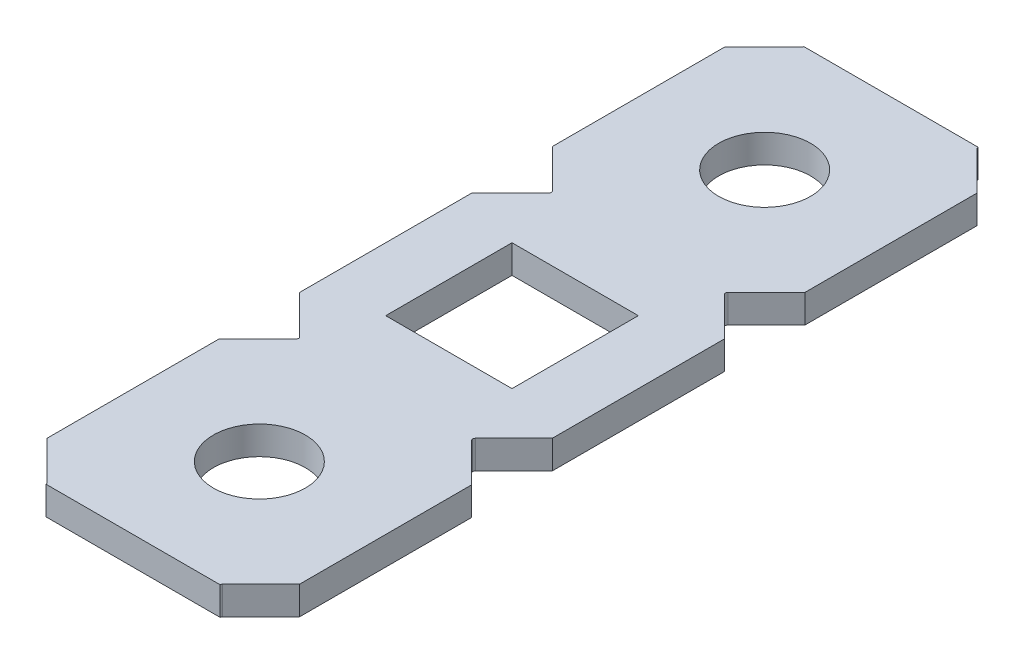
ISO-10303-21;
HEADER;
FILE_DESCRIPTION(('STEP AP214'),'2;1');
FILE_NAME('part.step','',(''),(''),'','','');
FILE_SCHEMA(('AUTOMOTIVE_DESIGN { 1 0 10303 214 1 1 1 1 }'));
ENDSEC;
DATA;
#1=APPLICATION_CONTEXT('core data for automotive mechanical design processes');
#2=APPLICATION_PROTOCOL_DEFINITION('international standard','automotive_design',2000,#1);
#3=PRODUCT_CONTEXT('',#1,'mechanical');
#4=PRODUCT('Part','Part','',(#3));
#5=PRODUCT_RELATED_PRODUCT_CATEGORY('part','',(#4));
#6=PRODUCT_DEFINITION_FORMATION('','',#4);
#7=PRODUCT_DEFINITION_CONTEXT('part definition',#1,'design');
#8=PRODUCT_DEFINITION('design','',#6,#7);
#9=PRODUCT_DEFINITION_SHAPE('','',#8);
#10=(LENGTH_UNIT() NAMED_UNIT(*) SI_UNIT(.MILLI.,.METRE.));
#11=(NAMED_UNIT(*) PLANE_ANGLE_UNIT() SI_UNIT($,.RADIAN.));
#12=(NAMED_UNIT(*) SI_UNIT($,.STERADIAN.) SOLID_ANGLE_UNIT());
#13=UNCERTAINTY_MEASURE_WITH_UNIT(LENGTH_MEASURE(1.E-05),#10,'distance_accuracy_value','');
#14=(GEOMETRIC_REPRESENTATION_CONTEXT(3) GLOBAL_UNCERTAINTY_ASSIGNED_CONTEXT((#13)) GLOBAL_UNIT_ASSIGNED_CONTEXT((#10,
#11,#12)) REPRESENTATION_CONTEXT('',''));
#15=CARTESIAN_POINT('',(0.,0.,0.));
#16=DIRECTION('',(0.,0.,1.));
#17=DIRECTION('',(1.,0.,0.));
#18=AXIS2_PLACEMENT_3D('',#15,#16,#17);
#19=CARTESIAN_POINT('',(10.85262006767,0.,-38.1));
#20=DIRECTION('',(0.,-1.,0.));
#21=DIRECTION('',(0.,0.,-1.));
#22=AXIS2_PLACEMENT_3D('',#19,#20,#21);
#23=CYLINDRICAL_SURFACE('',#22,0.127000000000002);
#24=CARTESIAN_POINT('',(10.85262006767,1.4224,-38.1));
#25=DIRECTION('',(0.,-1.,0.));
#26=DIRECTION('',(0.,0.,-1.));
#27=AXIS2_PLACEMENT_3D('',#24,#25,#26);
#28=CIRCLE('',#27,0.127000000000002);
#29=CARTESIAN_POINT('',(10.7628175064593,1.4224,-38.0101974387893));
#30=VERTEX_POINT('',#29);
#31=CARTESIAN_POINT('',(10.7628175064593,1.4224,-38.1898025612107));
#32=VERTEX_POINT('',#31);
#33=EDGE_CURVE('E313',#30,#32,#28,.T.);
#34=ORIENTED_EDGE('',*,*,#33,.F.);
#35=DIRECTION('',(0.,1.,0.));
#36=VECTOR('',#35,1.);
#37=CARTESIAN_POINT('',(10.7628175064593,0.,-38.0101974387893));
#38=LINE('',#37,#36);
#39=CARTESIAN_POINT('',(10.7628175064594,0.,-38.0101974387893));
#40=VERTEX_POINT('',#39);
#41=EDGE_CURVE('E526',#40,#30,#38,.T.);
#42=ORIENTED_EDGE('',*,*,#41,.F.);
#43=CARTESIAN_POINT('',(10.85262006767,0.,-38.1));
#44=DIRECTION('',(0.,1.,0.));
#45=DIRECTION('',(0.,0.,-1.));
#46=AXIS2_PLACEMENT_3D('',#43,#44,#45);
#47=CIRCLE('',#46,0.127000000000002);
#48=CARTESIAN_POINT('',(10.7628175064593,0.,-38.1898025612107));
#49=VERTEX_POINT('',#48);
#50=EDGE_CURVE('E547',#49,#40,#47,.T.);
#51=ORIENTED_EDGE('',*,*,#50,.F.);
#52=DIRECTION('',(0.,-1.,0.));
#53=VECTOR('',#52,1.);
#54=CARTESIAN_POINT('',(10.7628175064593,0.,-38.1898025612107));
#55=LINE('',#54,#53);
#56=EDGE_CURVE('E318',#32,#49,#55,.T.);
#57=ORIENTED_EDGE('',*,*,#56,.F.);
#58=EDGE_LOOP('',(#34,#42,#51,#57));
#59=FACE_BOUND('',#58,.T.);
#60=ADVANCED_FACE('F48',(#59),#23,.F.);
#61=CARTESIAN_POINT('',(10.85262006767,0.,-50.8));
#62=DIRECTION('',(0.,-1.,0.));
#63=DIRECTION('',(0.,0.,-1.));
#64=AXIS2_PLACEMENT_3D('',#61,#62,#63);
#65=CYLINDRICAL_SURFACE('',#64,0.127000000000002);
#66=CARTESIAN_POINT('',(10.85262006767,1.4224,-50.8));
#67=DIRECTION('',(0.,-1.,0.));
#68=DIRECTION('',(0.,0.,-1.));
#69=AXIS2_PLACEMENT_3D('',#66,#67,#68);
#70=CIRCLE('',#69,0.127000000000002);
#71=CARTESIAN_POINT('',(10.7628175064594,1.4224,-50.7101974387893));
#72=VERTEX_POINT('',#71);
#73=CARTESIAN_POINT('',(10.7628175064593,1.4224,-50.8898025612107));
#74=VERTEX_POINT('',#73);
#75=EDGE_CURVE('E423',#72,#74,#70,.T.);
#76=ORIENTED_EDGE('',*,*,#75,.F.);
#77=DIRECTION('',(0.,1.,0.));
#78=VECTOR('',#77,1.);
#79=CARTESIAN_POINT('',(10.7628175064594,0.,-50.7101974387893));
#80=LINE('',#79,#78);
#81=CARTESIAN_POINT('',(10.7628175064594,0.,-50.7101974387893));
#82=VERTEX_POINT('',#81);
#83=EDGE_CURVE('E417',#82,#72,#80,.T.);
#84=ORIENTED_EDGE('',*,*,#83,.F.);
#85=CARTESIAN_POINT('',(10.85262006767,0.,-50.8));
#86=DIRECTION('',(0.,1.,0.));
#87=DIRECTION('',(0.,0.,-1.));
#88=AXIS2_PLACEMENT_3D('',#85,#86,#87);
#89=CIRCLE('',#88,0.127000000000002);
#90=CARTESIAN_POINT('',(10.7628175064593,0.,-50.8898025612107));
#91=VERTEX_POINT('',#90);
#92=EDGE_CURVE('E345',#91,#82,#89,.T.);
#93=ORIENTED_EDGE('',*,*,#92,.F.);
#94=DIRECTION('',(0.,-1.,0.));
#95=VECTOR('',#94,1.);
#96=CARTESIAN_POINT('',(10.7628175064593,0.,-50.8898025612107));
#97=LINE('',#96,#95);
#98=EDGE_CURVE('E52',#74,#91,#97,.T.);
#99=ORIENTED_EDGE('',*,*,#98,.F.);
#100=EDGE_LOOP('',(#76,#84,#93,#99));
#101=FACE_BOUND('',#100,.T.);
#102=ADVANCED_FACE('F602',(#101),#65,.F.);
#103=CARTESIAN_POINT('',(10.85262006767,0.,-63.5));
#104=DIRECTION('',(0.,-1.,0.));
#105=DIRECTION('',(0.,0.,-1.));
#106=AXIS2_PLACEMENT_3D('',#103,#104,#105);
#107=CYLINDRICAL_SURFACE('',#106,0.127000000000002);
#108=DIRECTION('',(0.,1.,0.));
#109=VECTOR('',#108,1.);
#110=CARTESIAN_POINT('',(10.72562006767,0.,-63.5));
#111=LINE('',#110,#109);
#112=CARTESIAN_POINT('',(10.72562006767,0.,-63.5));
#113=VERTEX_POINT('',#112);
#114=CARTESIAN_POINT('',(10.72562006767,1.4224,-63.5));
#115=VERTEX_POINT('',#114);
#116=EDGE_CURVE('E485',#113,#115,#111,.T.);
#117=ORIENTED_EDGE('',*,*,#116,.T.);
#118=CARTESIAN_POINT('',(10.85262006767,1.4224,-63.5));
#119=DIRECTION('',(0.,-1.,0.));
#120=DIRECTION('',(0.,0.,-1.));
#121=AXIS2_PLACEMENT_3D('',#118,#119,#120);
#122=CIRCLE('',#121,0.127000000000002);
#123=CARTESIAN_POINT('',(10.7628175064593,1.4224,-63.4101974387893));
#124=VERTEX_POINT('',#123);
#125=EDGE_CURVE('E421',#124,#115,#122,.T.);
#126=ORIENTED_EDGE('',*,*,#125,.F.);
#127=DIRECTION('',(0.,1.,0.));
#128=VECTOR('',#127,1.);
#129=CARTESIAN_POINT('',(10.7628175064593,0.,-63.4101974387893));
#130=LINE('',#129,#128);
#131=CARTESIAN_POINT('',(10.7628175064593,0.,-63.4101974387893));
#132=VERTEX_POINT('',#131);
#133=EDGE_CURVE('E343',#132,#124,#130,.T.);
#134=ORIENTED_EDGE('',*,*,#133,.F.);
#135=CARTESIAN_POINT('',(10.85262006767,0.,-63.5));
#136=DIRECTION('',(0.,1.,0.));
#137=DIRECTION('',(0.,0.,-1.));
#138=AXIS2_PLACEMENT_3D('',#135,#136,#137);
#139=CIRCLE('',#138,0.127000000000002);
#140=EDGE_CURVE('E434',#113,#132,#139,.T.);
#141=ORIENTED_EDGE('',*,*,#140,.F.);
#142=EDGE_LOOP('',(#117,#126,#134,#141));
#143=FACE_BOUND('',#142,.T.);
#144=ADVANCED_FACE('F737',(#143),#107,.F.);
#145=CARTESIAN_POINT('',(1.84737993232992,1.4224,-63.5));
#146=DIRECTION('',(0.,1.,0.));
#147=DIRECTION('',(0.,0.,1.));
#148=AXIS2_PLACEMENT_3D('',#145,#146,#147);
#149=CYLINDRICAL_SURFACE('',#148,0.127000000000002);
#150=DIRECTION('',(0.,-1.,0.));
#151=VECTOR('',#150,1.);
#152=CARTESIAN_POINT('',(1.97437993232992,0.,-63.5));
#153=LINE('',#152,#151);
#154=CARTESIAN_POINT('',(1.97437993232992,1.4224,-63.5));
#155=VERTEX_POINT('',#154);
#156=CARTESIAN_POINT('',(1.97437993232992,0.,-63.5));
#157=VERTEX_POINT('',#156);
#158=EDGE_CURVE('E370',#155,#157,#153,.T.);
#159=ORIENTED_EDGE('',*,*,#158,.T.);
#160=CARTESIAN_POINT('',(1.84737993232992,0.,-63.5));
#161=DIRECTION('',(0.,1.,0.));
#162=DIRECTION('',(0.,0.,1.));
#163=AXIS2_PLACEMENT_3D('',#160,#161,#162);
#164=CIRCLE('',#163,0.127000000000002);
#165=CARTESIAN_POINT('',(1.93718249354061,0.,-63.4101974387893));
#166=VERTEX_POINT('',#165);
#167=EDGE_CURVE('E457',#166,#157,#164,.T.);
#168=ORIENTED_EDGE('',*,*,#167,.F.);
#169=DIRECTION('',(0.,1.,0.));
#170=VECTOR('',#169,1.);
#171=CARTESIAN_POINT('',(1.93718249354061,1.4224,-63.4101974387893));
#172=LINE('',#171,#170);
#173=CARTESIAN_POINT('',(1.93718249354061,1.4224,-63.4101974387893));
#174=VERTEX_POINT('',#173);
#175=EDGE_CURVE('E367',#166,#174,#172,.T.);
#176=ORIENTED_EDGE('',*,*,#175,.T.);
#177=CARTESIAN_POINT('',(1.84737993232992,1.4224,-63.5));
#178=DIRECTION('',(0.,-1.,0.));
#179=DIRECTION('',(1.09273919746569E-13,0.,1.));
#180=AXIS2_PLACEMENT_3D('',#177,#178,#179);
#181=CIRCLE('',#180,0.127000000000002);
#182=EDGE_CURVE('E290',#155,#174,#181,.T.);
#183=ORIENTED_EDGE('',*,*,#182,.F.);
#184=EDGE_LOOP('',(#159,#168,#176,#183));
#185=FACE_BOUND('',#184,.T.);
#186=ADVANCED_FACE('F832',(#185),#149,.F.);
#187=CARTESIAN_POINT('',(1.84737993232992,1.4224,-50.8));
#188=DIRECTION('',(0.,1.,0.));
#189=DIRECTION('',(0.,0.,1.));
#190=AXIS2_PLACEMENT_3D('',#187,#188,#189);
#191=CYLINDRICAL_SURFACE('',#190,0.127000000000002);
#192=CARTESIAN_POINT('',(1.84737993232992,0.,-50.8));
#193=DIRECTION('',(0.,1.,0.));
#194=DIRECTION('',(0.,0.,1.));
#195=AXIS2_PLACEMENT_3D('',#192,#193,#194);
#196=CIRCLE('',#195,0.127000000000002);
#197=CARTESIAN_POINT('',(1.93718249354061,0.,-50.7101974387893));
#198=VERTEX_POINT('',#197);
#199=CARTESIAN_POINT('',(1.93718249354061,0.,-50.8898025612107));
#200=VERTEX_POINT('',#199);
#201=EDGE_CURVE('E350',#198,#200,#196,.T.);
#202=ORIENTED_EDGE('',*,*,#201,.F.);
#203=DIRECTION('',(0.,1.,0.));
#204=VECTOR('',#203,1.);
#205=CARTESIAN_POINT('',(1.93718249354062,1.4224,-50.7101974387893));
#206=LINE('',#205,#204);
#207=CARTESIAN_POINT('',(1.93718249354062,1.4224,-50.7101974387893));
#208=VERTEX_POINT('',#207);
#209=EDGE_CURVE('E475',#198,#208,#206,.T.);
#210=ORIENTED_EDGE('',*,*,#209,.T.);
#211=CARTESIAN_POINT('',(1.84737993232992,1.4224,-50.8));
#212=DIRECTION('',(0.,-1.,0.));
#213=DIRECTION('',(0.,0.,1.));
#214=AXIS2_PLACEMENT_3D('',#211,#212,#213);
#215=CIRCLE('',#214,0.127000000000002);
#216=CARTESIAN_POINT('',(1.93718249354061,1.4224,-50.8898025612107));
#217=VERTEX_POINT('',#216);
#218=EDGE_CURVE('E59',#217,#208,#215,.T.);
#219=ORIENTED_EDGE('',*,*,#218,.F.);
#220=DIRECTION('',(0.,-1.,0.));
#221=VECTOR('',#220,1.);
#222=CARTESIAN_POINT('',(1.93718249354061,1.4224,-50.8898025612107));
#223=LINE('',#222,#221);
#224=EDGE_CURVE('E409',#217,#200,#223,.T.);
#225=ORIENTED_EDGE('',*,*,#224,.T.);
#226=EDGE_LOOP('',(#202,#210,#219,#225));
#227=FACE_BOUND('',#226,.T.);
#228=ADVANCED_FACE('F818',(#227),#191,.F.);
#229=CARTESIAN_POINT('',(1.84737993232993,1.4224,-38.1));
#230=DIRECTION('',(0.,1.,0.));
#231=DIRECTION('',(0.,0.,1.));
#232=AXIS2_PLACEMENT_3D('',#229,#230,#231);
#233=CYLINDRICAL_SURFACE('',#232,0.127000000000002);
#234=CARTESIAN_POINT('',(1.84737993232993,0.,-38.1));
#235=DIRECTION('',(0.,1.,0.));
#236=DIRECTION('',(0.,0.,1.));
#237=AXIS2_PLACEMENT_3D('',#234,#235,#236);
#238=CIRCLE('',#237,0.127000000000002);
#239=CARTESIAN_POINT('',(1.93718249354062,0.,-38.0101974387893));
#240=VERTEX_POINT('',#239);
#241=CARTESIAN_POINT('',(1.93718249354062,0.,-38.1898025612107));
#242=VERTEX_POINT('',#241);
#243=EDGE_CURVE('E411',#240,#242,#238,.T.);
#244=ORIENTED_EDGE('',*,*,#243,.F.);
#245=DIRECTION('',(0.,1.,0.));
#246=VECTOR('',#245,1.);
#247=CARTESIAN_POINT('',(1.93718249354062,1.4224,-38.0101974387893));
#248=LINE('',#247,#246);
#249=CARTESIAN_POINT('',(1.93718249354062,1.4224,-38.0101974387893));
#250=VERTEX_POINT('',#249);
#251=EDGE_CURVE('E496',#240,#250,#248,.T.);
#252=ORIENTED_EDGE('',*,*,#251,.T.);
#253=CARTESIAN_POINT('',(1.84737993232993,1.4224,-38.1));
#254=DIRECTION('',(0.,-1.,0.));
#255=DIRECTION('',(0.,0.,1.));
#256=AXIS2_PLACEMENT_3D('',#253,#254,#255);
#257=CIRCLE('',#256,0.127000000000002);
#258=CARTESIAN_POINT('',(1.93718249354062,1.4224,-38.1898025612107));
#259=VERTEX_POINT('',#258);
#260=EDGE_CURVE('E11',#259,#250,#257,.T.);
#261=ORIENTED_EDGE('',*,*,#260,.F.);
#262=DIRECTION('',(0.,-1.,0.));
#263=VECTOR('',#262,1.);
#264=CARTESIAN_POINT('',(1.93718249354062,1.4224,-38.1898025612107));
#265=LINE('',#264,#263);
#266=EDGE_CURVE('E466',#259,#242,#265,.T.);
#267=ORIENTED_EDGE('',*,*,#266,.T.);
#268=EDGE_LOOP('',(#244,#252,#261,#267));
#269=FACE_BOUND('',#268,.T.);
#270=ADVANCED_FACE('F745',(#269),#233,.F.);
#271=CARTESIAN_POINT('',(1.84737993232993,0.,-25.4));
#272=DIRECTION('',(0.,-1.,0.));
#273=DIRECTION('',(0.,0.,-1.));
#274=AXIS2_PLACEMENT_3D('',#271,#272,#273);
#275=CYLINDRICAL_SURFACE('',#274,0.126999999999999);
#276=CARTESIAN_POINT('',(1.84737993232993,1.4224,-25.4));
#277=DIRECTION('',(0.,-1.,0.));
#278=DIRECTION('',(0.,0.,-1.));
#279=AXIS2_PLACEMENT_3D('',#276,#277,#278);
#280=CIRCLE('',#279,0.126999999999999);
#281=CARTESIAN_POINT('',(1.93718249354062,1.4224,-25.4898025612107));
#282=VERTEX_POINT('',#281);
#283=CARTESIAN_POINT('',(1.97437993232992,1.4224,-25.4));
#284=VERTEX_POINT('',#283);
#285=EDGE_CURVE('E381',#282,#284,#280,.T.);
#286=ORIENTED_EDGE('',*,*,#285,.F.);
#287=DIRECTION('',(0.,-1.,0.));
#288=VECTOR('',#287,1.);
#289=CARTESIAN_POINT('',(1.93718249354062,0.,-25.4898025612107));
#290=LINE('',#289,#288);
#291=CARTESIAN_POINT('',(1.93718249354062,0.,-25.4898025612107));
#292=VERTEX_POINT('',#291);
#293=EDGE_CURVE('E542',#282,#292,#290,.T.);
#294=ORIENTED_EDGE('',*,*,#293,.T.);
#295=CARTESIAN_POINT('',(1.84737993232993,0.,-25.4));
#296=DIRECTION('',(0.,1.,0.));
#297=DIRECTION('',(0.,0.,-1.));
#298=AXIS2_PLACEMENT_3D('',#295,#296,#297);
#299=CIRCLE('',#298,0.126999999999999);
#300=CARTESIAN_POINT('',(1.97437993232992,0.,-25.4));
#301=VERTEX_POINT('',#300);
#302=EDGE_CURVE('E567',#301,#292,#299,.T.);
#303=ORIENTED_EDGE('',*,*,#302,.F.);
#304=DIRECTION('',(0.,-1.,0.));
#305=VECTOR('',#304,1.);
#306=CARTESIAN_POINT('',(1.97437993232992,0.,-25.4));
#307=LINE('',#306,#305);
#308=EDGE_CURVE('E372',#284,#301,#307,.T.);
#309=ORIENTED_EDGE('',*,*,#308,.F.);
#310=EDGE_LOOP('',(#286,#294,#303,#309));
#311=FACE_BOUND('',#310,.T.);
#312=ADVANCED_FACE('F742',(#311),#275,.F.);
#313=CARTESIAN_POINT('',(10.85262006767,0.,-25.4));
#314=DIRECTION('',(0.,-1.,0.));
#315=DIRECTION('',(0.,0.,-1.));
#316=AXIS2_PLACEMENT_3D('',#313,#314,#315);
#317=CYLINDRICAL_SURFACE('',#316,0.126999999999999);
#318=CARTESIAN_POINT('',(10.85262006767,0.,-25.4));
#319=DIRECTION('',(0.,1.,0.));
#320=DIRECTION('',(0.,0.,-1.));
#321=AXIS2_PLACEMENT_3D('',#318,#319,#320);
#322=CIRCLE('',#321,0.126999999999999);
#323=CARTESIAN_POINT('',(10.7628175064594,0.,-25.4898025612107));
#324=VERTEX_POINT('',#323);
#325=CARTESIAN_POINT('',(10.72562006767,0.,-25.4));
#326=VERTEX_POINT('',#325);
#327=EDGE_CURVE('E404',#324,#326,#322,.T.);
#328=ORIENTED_EDGE('',*,*,#327,.F.);
#329=DIRECTION('',(0.,-1.,0.));
#330=VECTOR('',#329,1.);
#331=CARTESIAN_POINT('',(10.7628175064594,0.,-25.4898025612107));
#332=LINE('',#331,#330);
#333=CARTESIAN_POINT('',(10.7628175064594,1.4224,-25.4898025612107));
#334=VERTEX_POINT('',#333);
#335=EDGE_CURVE('E365',#334,#324,#332,.T.);
#336=ORIENTED_EDGE('',*,*,#335,.F.);
#337=CARTESIAN_POINT('',(10.85262006767,1.4224,-25.4));
#338=DIRECTION('',(0.,-1.,0.));
#339=DIRECTION('',(0.,0.,-1.));
#340=AXIS2_PLACEMENT_3D('',#337,#338,#339);
#341=CIRCLE('',#340,0.126999999999999);
#342=CARTESIAN_POINT('',(10.72562006767,1.4224,-25.4));
#343=VERTEX_POINT('',#342);
#344=EDGE_CURVE('E377',#343,#334,#341,.T.);
#345=ORIENTED_EDGE('',*,*,#344,.F.);
#346=DIRECTION('',(0.,1.,0.));
#347=VECTOR('',#346,1.);
#348=CARTESIAN_POINT('',(10.72562006767,0.,-25.4));
#349=LINE('',#348,#347);
#350=EDGE_CURVE('E537',#326,#343,#349,.T.);
#351=ORIENTED_EDGE('',*,*,#350,.F.);
#352=EDGE_LOOP('',(#328,#336,#345,#351));
#353=FACE_BOUND('',#352,.T.);
#354=ADVANCED_FACE('F744',(#353),#317,.F.);
#355=CARTESIAN_POINT('',(0.,1.4224,0.));
#356=DIRECTION('',(0.,1.,0.));
#357=DIRECTION('',(1.,0.,0.));
#358=AXIS2_PLACEMENT_3D('',#355,#356,#357);
#359=PLANE('',#358);
#360=CARTESIAN_POINT('',(6.35000000000011,1.4224,-57.1500000000001));
#361=DIRECTION('',(0.,1.,0.));
#362=DIRECTION('',(0.,0.,1.));
#363=AXIS2_PLACEMENT_3D('',#360,#361,#362);
#364=CIRCLE('',#363,2.3114);
#365=CARTESIAN_POINT('',(6.35000000000011,1.4224,-54.8386000000001));
#366=VERTEX_POINT('',#365);
#367=EDGE_CURVE('E706',#366,#366,#364,.F.);
#368=ORIENTED_EDGE('',*,*,#367,.T.);
#369=EDGE_LOOP('',(#368));
#370=FACE_BOUND('',#369,.T.);
#371=CARTESIAN_POINT('',(6.35,1.4224,-31.75));
#372=DIRECTION('',(0.,1.,0.));
#373=DIRECTION('',(0.,0.,1.));
#374=AXIS2_PLACEMENT_3D('',#371,#372,#373);
#375=CIRCLE('',#374,2.3114);
#376=CARTESIAN_POINT('',(6.35,1.4224,-29.4386));
#377=VERTEX_POINT('',#376);
#378=EDGE_CURVE('E698',#377,#377,#375,.T.);
#379=ORIENTED_EDGE('',*,*,#378,.F.);
#380=EDGE_LOOP('',(#379));
#381=FACE_BOUND('',#380,.T.);
#382=DIRECTION('',(0.,0.,1.));
#383=VECTOR('',#382,1.);
#384=CARTESIAN_POINT('',(9.525,1.4224,-41.275));
#385=LINE('',#384,#383);
#386=CARTESIAN_POINT('',(9.525,1.4224,-47.625));
#387=VERTEX_POINT('',#386);
#388=CARTESIAN_POINT('',(9.525,1.4224,-41.275));
#389=VERTEX_POINT('',#388);
#390=EDGE_CURVE('E72',#387,#389,#385,.T.);
#391=ORIENTED_EDGE('',*,*,#390,.T.);
#392=DIRECTION('',(-1.,0.,0.));
#393=VECTOR('',#392,1.);
#394=CARTESIAN_POINT('',(3.17499999999996,1.4224,-41.275));
#395=LINE('',#394,#393);
#396=CARTESIAN_POINT('',(3.17499999999996,1.4224,-41.275));
#397=VERTEX_POINT('',#396);
#398=EDGE_CURVE('E450',#389,#397,#395,.T.);
#399=ORIENTED_EDGE('',*,*,#398,.T.);
#400=DIRECTION('',(0.,0.,-1.));
#401=VECTOR('',#400,1.);
#402=CARTESIAN_POINT('',(3.17499999999996,1.4224,-41.275));
#403=LINE('',#402,#401);
#404=CARTESIAN_POINT('',(3.17499999999996,1.4224,-47.625));
#405=VERTEX_POINT('',#404);
#406=EDGE_CURVE('E500',#397,#405,#403,.T.);
#407=ORIENTED_EDGE('',*,*,#406,.T.);
#408=DIRECTION('',(1.,0.,0.));
#409=VECTOR('',#408,1.);
#410=CARTESIAN_POINT('',(3.17499999999996,1.4224,-47.625));
#411=LINE('',#410,#409);
#412=EDGE_CURVE('E616',#405,#387,#411,.T.);
#413=ORIENTED_EDGE('',*,*,#412,.T.);
#414=EDGE_LOOP('',(#391,#399,#407,#413));
#415=FACE_BOUND('',#414,.T.);
#416=DIRECTION('',(0.,0.,1.));
#417=VECTOR('',#416,1.);
#418=CARTESIAN_POINT('',(0.,1.4224,-317.5));
#419=LINE('',#418,#417);
#420=CARTESIAN_POINT('',(0.,1.4224,-36.0730149452488));
#421=VERTEX_POINT('',#420);
#422=CARTESIAN_POINT('',(0.,1.4224,-27.4269850547513));
#423=VERTEX_POINT('',#422);
#424=EDGE_CURVE('E476',#421,#423,#419,.T.);
#425=ORIENTED_EDGE('',*,*,#424,.T.);
#426=DIRECTION('',(0.707106781186546,0.,0.707106781186549));
#427=VECTOR('',#426,1.);
#428=CARTESIAN_POINT('',(-0.254000000000248,1.4224,-27.6809850547516));
#429=LINE('',#428,#427);
#430=EDGE_CURVE('E375',#423,#282,#429,.T.);
#431=ORIENTED_EDGE('',*,*,#430,.T.);
#432=ORIENTED_EDGE('',*,*,#285,.T.);
#433=DIRECTION('',(-1.,0.,0.));
#434=VECTOR('',#433,1.);
#435=CARTESIAN_POINT('',(0.,1.4224,-25.4));
#436=LINE('',#435,#434);
#437=EDGE_CURVE('E376',#343,#284,#436,.T.);
#438=ORIENTED_EDGE('',*,*,#437,.F.);
#439=ORIENTED_EDGE('',*,*,#344,.T.);
#440=DIRECTION('',(-0.707106781186546,0.,0.70710678118655));
#441=VECTOR('',#440,1.);
#442=CARTESIAN_POINT('',(12.9540000000002,1.4224,-27.6809850547516));
#443=LINE('',#442,#441);
#444=CARTESIAN_POINT('',(12.7,1.4224,-27.4269850547514));
#445=VERTEX_POINT('',#444);
#446=EDGE_CURVE('E361',#445,#334,#443,.T.);
#447=ORIENTED_EDGE('',*,*,#446,.F.);
#448=DIRECTION('',(0.,0.,-1.));
#449=VECTOR('',#448,1.);
#450=CARTESIAN_POINT('',(12.7,1.4224,-317.5));
#451=LINE('',#450,#449);
#452=CARTESIAN_POINT('',(12.7,1.4224,-36.0730149452488));
#453=VERTEX_POINT('',#452);
#454=EDGE_CURVE('E366',#445,#453,#451,.T.);
#455=ORIENTED_EDGE('',*,*,#454,.T.);
#456=DIRECTION('',(0.707106781186549,0.,0.707106781186546));
#457=VECTOR('',#456,1.);
#458=CARTESIAN_POINT('',(10.6730149452487,1.4224,-38.1));
#459=LINE('',#458,#457);
#460=EDGE_CURVE('E521',#30,#453,#459,.T.);
#461=ORIENTED_EDGE('',*,*,#460,.F.);
#462=ORIENTED_EDGE('',*,*,#33,.T.);
#463=DIRECTION('',(-0.707106781186546,0.,0.70710678118655));
#464=VECTOR('',#463,1.);
#465=CARTESIAN_POINT('',(12.9540000000002,1.4224,-40.3809850547516));
#466=LINE('',#465,#464);
#467=CARTESIAN_POINT('',(12.7,1.4224,-40.1269850547514));
#468=VERTEX_POINT('',#467);
#469=EDGE_CURVE('E306',#468,#32,#466,.T.);
#470=ORIENTED_EDGE('',*,*,#469,.F.);
#471=DIRECTION('',(0.,0.,-1.));
#472=VECTOR('',#471,1.);
#473=CARTESIAN_POINT('',(12.7,1.4224,-317.5));
#474=LINE('',#473,#472);
#475=CARTESIAN_POINT('',(12.7,1.4224,-48.7730149452487));
#476=VERTEX_POINT('',#475);
#477=EDGE_CURVE('E310',#468,#476,#474,.T.);
#478=ORIENTED_EDGE('',*,*,#477,.T.);
#479=DIRECTION('',(0.707106781186549,0.,0.707106781186546));
#480=VECTOR('',#479,1.);
#481=CARTESIAN_POINT('',(10.6730149452487,1.4224,-50.8));
#482=LINE('',#481,#480);
#483=EDGE_CURVE('E339',#72,#476,#482,.T.);
#484=ORIENTED_EDGE('',*,*,#483,.F.);
#485=ORIENTED_EDGE('',*,*,#75,.T.);
#486=DIRECTION('',(-0.707106781186546,0.,0.70710678118655));
#487=VECTOR('',#486,1.);
#488=CARTESIAN_POINT('',(12.9540000000002,1.4224,-53.0809850547516));
#489=LINE('',#488,#487);
#490=CARTESIAN_POINT('',(12.7,1.4224,-52.8269850547514));
#491=VERTEX_POINT('',#490);
#492=EDGE_CURVE('E385',#491,#74,#489,.T.);
#493=ORIENTED_EDGE('',*,*,#492,.F.);
#494=DIRECTION('',(0.,0.,-1.));
#495=VECTOR('',#494,1.);
#496=CARTESIAN_POINT('',(12.7,1.4224,-317.5));
#497=LINE('',#496,#495);
#498=CARTESIAN_POINT('',(12.7,1.4224,-61.4730149452488));
#499=VERTEX_POINT('',#498);
#500=EDGE_CURVE('E382',#491,#499,#497,.T.);
#501=ORIENTED_EDGE('',*,*,#500,.T.);
#502=DIRECTION('',(0.707106781186549,0.,0.707106781186546));
#503=VECTOR('',#502,1.);
#504=CARTESIAN_POINT('',(10.6730149452487,1.4224,-63.5));
#505=LINE('',#504,#503);
#506=EDGE_CURVE('E510',#124,#499,#505,.T.);
#507=ORIENTED_EDGE('',*,*,#506,.F.);
#508=ORIENTED_EDGE('',*,*,#125,.T.);
#509=DIRECTION('',(-1.,0.,0.));
#510=VECTOR('',#509,1.);
#511=CARTESIAN_POINT('',(0.,1.4224,-63.5));
#512=LINE('',#511,#510);
#513=EDGE_CURVE('E389',#115,#155,#512,.T.);
#514=ORIENTED_EDGE('',*,*,#513,.T.);
#515=ORIENTED_EDGE('',*,*,#182,.T.);
#516=DIRECTION('',(-0.707106781186549,0.,0.707106781186546));
#517=VECTOR('',#516,1.);
#518=CARTESIAN_POINT('',(2.0269850547513,1.4224,-63.5));
#519=LINE('',#518,#517);
#520=CARTESIAN_POINT('',(0.,1.4224,-61.4730149452488));
#521=VERTEX_POINT('',#520);
#522=EDGE_CURVE('E371',#174,#521,#519,.T.);
#523=ORIENTED_EDGE('',*,*,#522,.T.);
#524=DIRECTION('',(0.,0.,1.));
#525=VECTOR('',#524,1.);
#526=CARTESIAN_POINT('',(0.,1.4224,-317.5));
#527=LINE('',#526,#525);
#528=CARTESIAN_POINT('',(0.,1.4224,-52.8269850547514));
#529=VERTEX_POINT('',#528);
#530=EDGE_CURVE('E439',#521,#529,#527,.T.);
#531=ORIENTED_EDGE('',*,*,#530,.T.);
#532=DIRECTION('',(0.707106781186546,0.,0.707106781186549));
#533=VECTOR('',#532,1.);
#534=CARTESIAN_POINT('',(-0.254000000000255,1.4224,-53.0809850547516));
#535=LINE('',#534,#533);
#536=EDGE_CURVE('E410',#529,#217,#535,.T.);
#537=ORIENTED_EDGE('',*,*,#536,.T.);
#538=ORIENTED_EDGE('',*,*,#218,.T.);
#539=DIRECTION('',(-0.707106781186549,0.,0.707106781186546));
#540=VECTOR('',#539,1.);
#541=CARTESIAN_POINT('',(2.02698505475131,1.4224,-50.8));
#542=LINE('',#541,#540);
#543=CARTESIAN_POINT('',(0.,1.4224,-48.7730149452488));
#544=VERTEX_POINT('',#543);
#545=EDGE_CURVE('E429',#208,#544,#542,.T.);
#546=ORIENTED_EDGE('',*,*,#545,.T.);
#547=DIRECTION('',(0.,0.,1.));
#548=VECTOR('',#547,1.);
#549=CARTESIAN_POINT('',(0.,1.4224,-317.5));
#550=LINE('',#549,#548);
#551=CARTESIAN_POINT('',(0.,1.4224,-40.1269850547514));
#552=VERTEX_POINT('',#551);
#553=EDGE_CURVE('E430',#544,#552,#550,.T.);
#554=ORIENTED_EDGE('',*,*,#553,.T.);
#555=DIRECTION('',(0.707106781186546,0.,0.707106781186549));
#556=VECTOR('',#555,1.);
#557=CARTESIAN_POINT('',(-0.254000000000251,1.4224,-40.3809850547516));
#558=LINE('',#557,#556);
#559=EDGE_CURVE('E467',#552,#259,#558,.T.);
#560=ORIENTED_EDGE('',*,*,#559,.T.);
#561=ORIENTED_EDGE('',*,*,#260,.T.);
#562=DIRECTION('',(-0.707106781186549,0.,0.707106781186546));
#563=VECTOR('',#562,1.);
#564=CARTESIAN_POINT('',(2.02698505475131,1.4224,-38.1));
#565=LINE('',#564,#563);
#566=EDGE_CURVE('E479',#250,#421,#565,.T.);
#567=ORIENTED_EDGE('',*,*,#566,.T.);
#568=EDGE_LOOP('',(#425,#431,#432,#438,#439,#447,#455,#461,#462,#470,#478,#484,#485,#493,#501,
#507,#508,#514,#515,#523,#531,#537,#538,#546,#554,#560,#561,#567));
#569=FACE_BOUND('',#568,.T.);
#570=ADVANCED_FACE('F308',(#370,#381,#415,#569),#359,.T.);
#571=CARTESIAN_POINT('',(9.525,0.,-41.275));
#572=DIRECTION('',(1.,0.,0.));
#573=DIRECTION('',(0.,0.,-1.));
#574=AXIS2_PLACEMENT_3D('',#571,#572,#573);
#575=PLANE('',#574);
#576=DIRECTION('',(0.,-1.,0.));
#577=VECTOR('',#576,1.);
#578=CARTESIAN_POINT('',(9.525,0.,-47.625));
#579=LINE('',#578,#577);
#580=CARTESIAN_POINT('',(9.525,0.,-47.625));
#581=VERTEX_POINT('',#580);
#582=EDGE_CURVE('E612',#387,#581,#579,.T.);
#583=ORIENTED_EDGE('',*,*,#582,.T.);
#584=DIRECTION('',(0.,0.,1.));
#585=VECTOR('',#584,1.);
#586=CARTESIAN_POINT('',(9.525,0.,0.));
#587=LINE('',#586,#585);
#588=CARTESIAN_POINT('',(9.525,0.,-41.275));
#589=VERTEX_POINT('',#588);
#590=EDGE_CURVE('E580',#581,#589,#587,.T.);
#591=ORIENTED_EDGE('',*,*,#590,.T.);
#592=DIRECTION('',(0.,1.,0.));
#593=VECTOR('',#592,1.);
#594=CARTESIAN_POINT('',(9.525,0.,-41.275));
#595=LINE('',#594,#593);
#596=EDGE_CURVE('E453',#589,#389,#595,.T.);
#597=ORIENTED_EDGE('',*,*,#596,.T.);
#598=ORIENTED_EDGE('',*,*,#390,.F.);
#599=EDGE_LOOP('',(#583,#591,#597,#598));
#600=FACE_BOUND('',#599,.T.);
#601=ADVANCED_FACE('F653',(#600),#575,.F.);
#602=CARTESIAN_POINT('',(3.17499999999996,0.,-41.275));
#603=DIRECTION('',(0.,0.,1.));
#604=DIRECTION('',(1.,0.,0.));
#605=AXIS2_PLACEMENT_3D('',#602,#603,#604);
#606=PLANE('',#605);
#607=ORIENTED_EDGE('',*,*,#596,.F.);
#608=DIRECTION('',(-1.,0.,0.));
#609=VECTOR('',#608,1.);
#610=CARTESIAN_POINT('',(0.,0.,-41.275));
#611=LINE('',#610,#609);
#612=CARTESIAN_POINT('',(3.17499999999996,0.,-41.275));
#613=VERTEX_POINT('',#612);
#614=EDGE_CURVE('E576',#589,#613,#611,.T.);
#615=ORIENTED_EDGE('',*,*,#614,.T.);
#616=DIRECTION('',(0.,1.,0.));
#617=VECTOR('',#616,1.);
#618=CARTESIAN_POINT('',(3.17499999999996,0.,-41.275));
#619=LINE('',#618,#617);
#620=EDGE_CURVE('E503',#613,#397,#619,.T.);
#621=ORIENTED_EDGE('',*,*,#620,.T.);
#622=ORIENTED_EDGE('',*,*,#398,.F.);
#623=EDGE_LOOP('',(#607,#615,#621,#622));
#624=FACE_BOUND('',#623,.T.);
#625=ADVANCED_FACE('F660',(#624),#606,.F.);
#626=CARTESIAN_POINT('',(3.17499999999996,0.,-41.275));
#627=DIRECTION('',(-1.,0.,0.));
#628=DIRECTION('',(0.,1.,0.));
#629=AXIS2_PLACEMENT_3D('',#626,#627,#628);
#630=PLANE('',#629);
#631=ORIENTED_EDGE('',*,*,#620,.F.);
#632=DIRECTION('',(0.,0.,-1.));
#633=VECTOR('',#632,1.);
#634=CARTESIAN_POINT('',(3.17499999999996,0.,0.));
#635=LINE('',#634,#633);
#636=CARTESIAN_POINT('',(3.17499999999996,0.,-47.625));
#637=VERTEX_POINT('',#636);
#638=EDGE_CURVE('E403',#613,#637,#635,.T.);
#639=ORIENTED_EDGE('',*,*,#638,.T.);
#640=DIRECTION('',(0.,1.,0.));
#641=VECTOR('',#640,1.);
#642=CARTESIAN_POINT('',(3.17499999999996,0.,-47.625));
#643=LINE('',#642,#641);
#644=EDGE_CURVE('E617',#637,#405,#643,.T.);
#645=ORIENTED_EDGE('',*,*,#644,.T.);
#646=ORIENTED_EDGE('',*,*,#406,.F.);
#647=EDGE_LOOP('',(#631,#639,#645,#646));
#648=FACE_BOUND('',#647,.T.);
#649=ADVANCED_FACE('F665',(#648),#630,.F.);
#650=CARTESIAN_POINT('',(3.17499999999996,0.,-47.625));
#651=DIRECTION('',(0.,0.,-1.));
#652=DIRECTION('',(-1.,0.,0.));
#653=AXIS2_PLACEMENT_3D('',#650,#651,#652);
#654=PLANE('',#653);
#655=ORIENTED_EDGE('',*,*,#644,.F.);
#656=DIRECTION('',(1.,0.,0.));
#657=VECTOR('',#656,1.);
#658=CARTESIAN_POINT('',(0.,0.,-47.625));
#659=LINE('',#658,#657);
#660=EDGE_CURVE('E541',#637,#581,#659,.T.);
#661=ORIENTED_EDGE('',*,*,#660,.T.);
#662=ORIENTED_EDGE('',*,*,#582,.F.);
#663=ORIENTED_EDGE('',*,*,#412,.F.);
#664=EDGE_LOOP('',(#655,#661,#662,#663));
#665=FACE_BOUND('',#664,.T.);
#666=ADVANCED_FACE('F865',(#665),#654,.F.);
#667=CARTESIAN_POINT('',(12.9540000000002,0.,-27.6809850547516));
#668=DIRECTION('',(0.70710678118655,0.,0.707106781186546));
#669=DIRECTION('',(0.,-1.,0.));
#670=AXIS2_PLACEMENT_3D('',#667,#668,#669);
#671=PLANE('',#670);
#672=ORIENTED_EDGE('',*,*,#446,.T.);
#673=ORIENTED_EDGE('',*,*,#335,.T.);
#674=DIRECTION('',(0.707106781186523,0.,-0.707106781186572));
#675=VECTOR('',#674,1.);
#676=CARTESIAN_POINT('',(10.7628175064594,0.,-25.4898025612107));
#677=LINE('',#676,#675);
#678=CARTESIAN_POINT('',(12.7,0.,-27.4269850547515));
#679=VERTEX_POINT('',#678);
#680=EDGE_CURVE('E461',#324,#679,#677,.T.);
#681=ORIENTED_EDGE('',*,*,#680,.T.);
#682=DIRECTION('',(0.,1.,0.));
#683=VECTOR('',#682,1.);
#684=CARTESIAN_POINT('',(12.7,1.4224,-27.4269850547515));
#685=LINE('',#684,#683);
#686=EDGE_CURVE('E449',#679,#445,#685,.T.);
#687=ORIENTED_EDGE('',*,*,#686,.T.);
#688=EDGE_LOOP('',(#672,#673,#681,#687));
#689=FACE_BOUND('',#688,.T.);
#690=ADVANCED_FACE('F773',(#689),#671,.T.);
#691=CARTESIAN_POINT('',(12.7,1.4224,-317.5));
#692=DIRECTION('',(-1.,0.,0.));
#693=DIRECTION('',(0.,1.,0.));
#694=AXIS2_PLACEMENT_3D('',#691,#692,#693);
#695=PLANE('',#694);
#696=ORIENTED_EDGE('',*,*,#686,.F.);
#697=DIRECTION('',(0.,0.,-1.));
#698=VECTOR('',#697,1.);
#699=CARTESIAN_POINT('',(12.7,0.,0.));
#700=LINE('',#699,#698);
#701=CARTESIAN_POINT('',(12.7,0.,-36.0730149452488));
#702=VERTEX_POINT('',#701);
#703=EDGE_CURVE('E511',#679,#702,#700,.T.);
#704=ORIENTED_EDGE('',*,*,#703,.T.);
#705=DIRECTION('',(0.,-1.,0.));
#706=VECTOR('',#705,1.);
#707=CARTESIAN_POINT('',(12.6999999999999,0.,-36.0730149452488));
#708=LINE('',#707,#706);
#709=EDGE_CURVE('E525',#453,#702,#708,.T.);
#710=ORIENTED_EDGE('',*,*,#709,.F.);
#711=ORIENTED_EDGE('',*,*,#454,.F.);
#712=EDGE_LOOP('',(#696,#704,#710,#711));
#713=FACE_BOUND('',#712,.T.);
#714=ADVANCED_FACE('F777',(#713),#695,.F.);
#715=CARTESIAN_POINT('',(10.6730149452487,0.,-38.1));
#716=DIRECTION('',(0.707106781186546,0.,-0.707106781186549));
#717=DIRECTION('',(0.,-1.,0.));
#718=AXIS2_PLACEMENT_3D('',#715,#716,#717);
#719=PLANE('',#718);
#720=DIRECTION('',(-0.707106781186549,0.,-0.707106781186546));
#721=VECTOR('',#720,1.);
#722=CARTESIAN_POINT('',(12.7,0.,-36.0730149452488));
#723=LINE('',#722,#721);
#724=EDGE_CURVE('E515',#702,#40,#723,.T.);
#725=ORIENTED_EDGE('',*,*,#724,.T.);
#726=ORIENTED_EDGE('',*,*,#41,.T.);
#727=ORIENTED_EDGE('',*,*,#460,.T.);
#728=ORIENTED_EDGE('',*,*,#709,.T.);
#729=EDGE_LOOP('',(#725,#726,#727,#728));
#730=FACE_BOUND('',#729,.T.);
#731=ADVANCED_FACE('F781',(#730),#719,.T.);
#732=CARTESIAN_POINT('',(12.9540000000002,0.,-40.3809850547516));
#733=DIRECTION('',(0.70710678118655,0.,0.707106781186546));
#734=DIRECTION('',(0.,-1.,0.));
#735=AXIS2_PLACEMENT_3D('',#732,#733,#734);
#736=PLANE('',#735);
#737=ORIENTED_EDGE('',*,*,#469,.T.);
#738=ORIENTED_EDGE('',*,*,#56,.T.);
#739=DIRECTION('',(0.707106781186525,0.,-0.70710678118657));
#740=VECTOR('',#739,1.);
#741=CARTESIAN_POINT('',(10.7628175064593,0.,-38.1898025612107));
#742=LINE('',#741,#740);
#743=CARTESIAN_POINT('',(12.7,0.,-40.1269850547515));
#744=VERTEX_POINT('',#743);
#745=EDGE_CURVE('E331',#49,#744,#742,.T.);
#746=ORIENTED_EDGE('',*,*,#745,.T.);
#747=DIRECTION('',(0.,1.,0.));
#748=VECTOR('',#747,1.);
#749=CARTESIAN_POINT('',(12.7,1.4224,-40.1269850547515));
#750=LINE('',#749,#748);
#751=EDGE_CURVE('E323',#744,#468,#750,.T.);
#752=ORIENTED_EDGE('',*,*,#751,.T.);
#753=EDGE_LOOP('',(#737,#738,#746,#752));
#754=FACE_BOUND('',#753,.T.);
#755=ADVANCED_FACE('F329',(#754),#736,.T.);
#756=CARTESIAN_POINT('',(12.7,1.4224,-317.5));
#757=DIRECTION('',(-1.,0.,0.));
#758=DIRECTION('',(0.,1.,0.));
#759=AXIS2_PLACEMENT_3D('',#756,#757,#758);
#760=PLANE('',#759);
#761=ORIENTED_EDGE('',*,*,#751,.F.);
#762=DIRECTION('',(0.,0.,-1.));
#763=VECTOR('',#762,1.);
#764=CARTESIAN_POINT('',(12.7,0.,0.));
#765=LINE('',#764,#763);
#766=CARTESIAN_POINT('',(12.7,0.,-48.7730149452487));
#767=VERTEX_POINT('',#766);
#768=EDGE_CURVE('E495',#744,#767,#765,.T.);
#769=ORIENTED_EDGE('',*,*,#768,.T.);
#770=DIRECTION('',(0.,-1.,0.));
#771=VECTOR('',#770,1.);
#772=CARTESIAN_POINT('',(12.7,0.,-48.7730149452487));
#773=LINE('',#772,#771);
#774=EDGE_CURVE('E325',#476,#767,#773,.T.);
#775=ORIENTED_EDGE('',*,*,#774,.F.);
#776=ORIENTED_EDGE('',*,*,#477,.F.);
#777=EDGE_LOOP('',(#761,#769,#775,#776));
#778=FACE_BOUND('',#777,.T.);
#779=ADVANCED_FACE('F321',(#778),#760,.F.);
#780=CARTESIAN_POINT('',(10.6730149452487,0.,-50.8));
#781=DIRECTION('',(0.707106781186546,0.,-0.707106781186549));
#782=DIRECTION('',(0.,-1.,0.));
#783=AXIS2_PLACEMENT_3D('',#780,#781,#782);
#784=PLANE('',#783);
#785=DIRECTION('',(-0.70710678118655,0.,-0.707106781186545));
#786=VECTOR('',#785,1.);
#787=CARTESIAN_POINT('',(12.7,0.,-48.7730149452487));
#788=LINE('',#787,#786);
#789=EDGE_CURVE('E348',#767,#82,#788,.T.);
#790=ORIENTED_EDGE('',*,*,#789,.T.);
#791=ORIENTED_EDGE('',*,*,#83,.T.);
#792=ORIENTED_EDGE('',*,*,#483,.T.);
#793=ORIENTED_EDGE('',*,*,#774,.T.);
#794=EDGE_LOOP('',(#790,#791,#792,#793));
#795=FACE_BOUND('',#794,.T.);
#796=ADVANCED_FACE('F596',(#795),#784,.T.);
#797=CARTESIAN_POINT('',(12.9540000000002,0.,-53.0809850547516));
#798=DIRECTION('',(0.70710678118655,0.,0.707106781186546));
#799=DIRECTION('',(0.,-1.,0.));
#800=AXIS2_PLACEMENT_3D('',#797,#798,#799);
#801=PLANE('',#800);
#802=ORIENTED_EDGE('',*,*,#492,.T.);
#803=ORIENTED_EDGE('',*,*,#98,.T.);
#804=DIRECTION('',(0.707106781186524,0.,-0.707106781186571));
#805=VECTOR('',#804,1.);
#806=CARTESIAN_POINT('',(10.7628175064593,0.,-50.8898025612107));
#807=LINE('',#806,#805);
#808=CARTESIAN_POINT('',(12.7,0.,-52.8269850547514));
#809=VERTEX_POINT('',#808);
#810=EDGE_CURVE('E349',#91,#809,#807,.T.);
#811=ORIENTED_EDGE('',*,*,#810,.T.);
#812=DIRECTION('',(0.,1.,0.));
#813=VECTOR('',#812,1.);
#814=CARTESIAN_POINT('',(12.7,1.4224,-52.8269850547514));
#815=LINE('',#814,#813);
#816=EDGE_CURVE('E386',#809,#491,#815,.T.);
#817=ORIENTED_EDGE('',*,*,#816,.T.);
#818=EDGE_LOOP('',(#802,#803,#811,#817));
#819=FACE_BOUND('',#818,.T.);
#820=ADVANCED_FACE('F604',(#819),#801,.T.);
#821=CARTESIAN_POINT('',(12.7,1.4224,-317.5));
#822=DIRECTION('',(-1.,0.,0.));
#823=DIRECTION('',(0.,1.,0.));
#824=AXIS2_PLACEMENT_3D('',#821,#822,#823);
#825=PLANE('',#824);
#826=ORIENTED_EDGE('',*,*,#816,.F.);
#827=DIRECTION('',(0.,0.,-1.));
#828=VECTOR('',#827,1.);
#829=CARTESIAN_POINT('',(12.7,0.,0.));
#830=LINE('',#829,#828);
#831=CARTESIAN_POINT('',(12.7,0.,-61.4730149452487));
#832=VERTEX_POINT('',#831);
#833=EDGE_CURVE('E394',#809,#832,#830,.T.);
#834=ORIENTED_EDGE('',*,*,#833,.T.);
#835=DIRECTION('',(0.,-1.,0.));
#836=VECTOR('',#835,1.);
#837=CARTESIAN_POINT('',(12.7,0.,-61.4730149452488));
#838=LINE('',#837,#836);
#839=EDGE_CURVE('E393',#499,#832,#838,.T.);
#840=ORIENTED_EDGE('',*,*,#839,.F.);
#841=ORIENTED_EDGE('',*,*,#500,.F.);
#842=EDGE_LOOP('',(#826,#834,#840,#841));
#843=FACE_BOUND('',#842,.T.);
#844=ADVANCED_FACE('F848',(#843),#825,.F.);
#845=CARTESIAN_POINT('',(10.6730149452487,0.,-63.5));
#846=DIRECTION('',(0.707106781186546,0.,-0.707106781186549));
#847=DIRECTION('',(0.,-1.,0.));
#848=AXIS2_PLACEMENT_3D('',#845,#846,#847);
#849=PLANE('',#848);
#850=DIRECTION('',(-0.70710678118655,0.,-0.707106781186545));
#851=VECTOR('',#850,1.);
#852=CARTESIAN_POINT('',(12.7,0.,-61.4730149452488));
#853=LINE('',#852,#851);
#854=EDGE_CURVE('E398',#832,#132,#853,.T.);
#855=ORIENTED_EDGE('',*,*,#854,.T.);
#856=ORIENTED_EDGE('',*,*,#133,.T.);
#857=ORIENTED_EDGE('',*,*,#506,.T.);
#858=ORIENTED_EDGE('',*,*,#839,.T.);
#859=EDGE_LOOP('',(#855,#856,#857,#858));
#860=FACE_BOUND('',#859,.T.);
#861=ADVANCED_FACE('F844',(#860),#849,.T.);
#862=CARTESIAN_POINT('',(0.,0.,-63.5));
#863=DIRECTION('',(0.,0.,1.));
#864=DIRECTION('',(1.,0.,0.));
#865=AXIS2_PLACEMENT_3D('',#862,#863,#864);
#866=PLANE('',#865);
#867=ORIENTED_EDGE('',*,*,#158,.F.);
#868=ORIENTED_EDGE('',*,*,#513,.F.);
#869=ORIENTED_EDGE('',*,*,#116,.F.);
#870=DIRECTION('',(-1.,0.,0.));
#871=VECTOR('',#870,1.);
#872=CARTESIAN_POINT('',(0.,0.,-63.5));
#873=LINE('',#872,#871);
#874=EDGE_CURVE('E468',#113,#157,#873,.T.);
#875=ORIENTED_EDGE('',*,*,#874,.T.);
#876=EDGE_LOOP('',(#867,#868,#869,#875));
#877=FACE_BOUND('',#876,.T.);
#878=ADVANCED_FACE('F838',(#877),#866,.F.);
#879=CARTESIAN_POINT('',(2.0269850547513,1.4224,-63.5));
#880=DIRECTION('',(0.707106781186546,0.,0.707106781186549));
#881=DIRECTION('',(0.,-1.,0.));
#882=AXIS2_PLACEMENT_3D('',#879,#880,#881);
#883=PLANE('',#882);
#884=DIRECTION('',(-0.707106781186572,0.,0.707106781186524));
#885=VECTOR('',#884,1.);
#886=CARTESIAN_POINT('',(1.93718249354061,0.,-63.4101974387893));
#887=LINE('',#886,#885);
#888=CARTESIAN_POINT('',(0.,0.,-61.4730149452488));
#889=VERTEX_POINT('',#888);
#890=EDGE_CURVE('E360',#166,#889,#887,.T.);
#891=ORIENTED_EDGE('',*,*,#890,.T.);
#892=DIRECTION('',(0.,1.,0.));
#893=VECTOR('',#892,1.);
#894=CARTESIAN_POINT('',(0.,1.4224,-61.4730149452488));
#895=LINE('',#894,#893);
#896=EDGE_CURVE('E435',#889,#521,#895,.T.);
#897=ORIENTED_EDGE('',*,*,#896,.T.);
#898=ORIENTED_EDGE('',*,*,#522,.F.);
#899=ORIENTED_EDGE('',*,*,#175,.F.);
#900=EDGE_LOOP('',(#891,#897,#898,#899));
#901=FACE_BOUND('',#900,.T.);
#902=ADVANCED_FACE('F830',(#901),#883,.F.);
#903=CARTESIAN_POINT('',(0.,1.4224,-317.5));
#904=DIRECTION('',(1.,0.,0.));
#905=DIRECTION('',(0.,0.,-1.));
#906=AXIS2_PLACEMENT_3D('',#903,#904,#905);
#907=PLANE('',#906);
#908=DIRECTION('',(0.,1.,0.));
#909=VECTOR('',#908,1.);
#910=CARTESIAN_POINT('',(0.,1.4224,-52.8269850547514));
#911=LINE('',#910,#909);
#912=CARTESIAN_POINT('',(0.,0.,-52.8269850547513));
#913=VERTEX_POINT('',#912);
#914=EDGE_CURVE('E405',#913,#529,#911,.T.);
#915=ORIENTED_EDGE('',*,*,#914,.T.);
#916=ORIENTED_EDGE('',*,*,#530,.F.);
#917=ORIENTED_EDGE('',*,*,#896,.F.);
#918=DIRECTION('',(0.,0.,1.));
#919=VECTOR('',#918,1.);
#920=CARTESIAN_POINT('',(0.,0.,0.));
#921=LINE('',#920,#919);
#922=EDGE_CURVE('E356',#889,#913,#921,.T.);
#923=ORIENTED_EDGE('',*,*,#922,.T.);
#924=EDGE_LOOP('',(#915,#916,#917,#923));
#925=FACE_BOUND('',#924,.T.);
#926=ADVANCED_FACE('F826',(#925),#907,.F.);
#927=CARTESIAN_POINT('',(-0.254000000000255,1.4224,-53.0809850547516));
#928=DIRECTION('',(0.707106781186549,0.,-0.707106781186546));
#929=DIRECTION('',(0.,-1.,0.));
#930=AXIS2_PLACEMENT_3D('',#927,#928,#929);
#931=PLANE('',#930);
#932=ORIENTED_EDGE('',*,*,#536,.F.);
#933=ORIENTED_EDGE('',*,*,#914,.F.);
#934=DIRECTION('',(0.707106781186546,0.,0.70710678118655));
#935=VECTOR('',#934,1.);
#936=CARTESIAN_POINT('',(0.,0.,-52.8269850547514));
#937=LINE('',#936,#935);
#938=EDGE_CURVE('E354',#913,#200,#937,.T.);
#939=ORIENTED_EDGE('',*,*,#938,.T.);
#940=ORIENTED_EDGE('',*,*,#224,.F.);
#941=EDGE_LOOP('',(#932,#933,#939,#940));
#942=FACE_BOUND('',#941,.T.);
#943=ADVANCED_FACE('F822',(#942),#931,.F.);
#944=CARTESIAN_POINT('',(2.02698505475131,1.4224,-50.8));
#945=DIRECTION('',(0.707106781186546,0.,0.707106781186549));
#946=DIRECTION('',(0.,-1.,0.));
#947=AXIS2_PLACEMENT_3D('',#944,#945,#946);
#948=PLANE('',#947);
#949=DIRECTION('',(-0.707106781186576,0.,0.707106781186519));
#950=VECTOR('',#949,1.);
#951=CARTESIAN_POINT('',(1.93718249354062,0.,-50.7101974387893));
#952=LINE('',#951,#950);
#953=CARTESIAN_POINT('',(0.,0.,-48.7730149452488));
#954=VERTEX_POINT('',#953);
#955=EDGE_CURVE('E355',#198,#954,#952,.T.);
#956=ORIENTED_EDGE('',*,*,#955,.T.);
#957=DIRECTION('',(0.,1.,0.));
#958=VECTOR('',#957,1.);
#959=CARTESIAN_POINT('',(0.,1.4224,-48.7730149452488));
#960=LINE('',#959,#958);
#961=EDGE_CURVE('E425',#954,#544,#960,.T.);
#962=ORIENTED_EDGE('',*,*,#961,.T.);
#963=ORIENTED_EDGE('',*,*,#545,.F.);
#964=ORIENTED_EDGE('',*,*,#209,.F.);
#965=EDGE_LOOP('',(#956,#962,#963,#964));
#966=FACE_BOUND('',#965,.T.);
#967=ADVANCED_FACE('F815',(#966),#948,.F.);
#968=CARTESIAN_POINT('',(0.,1.4224,-317.5));
#969=DIRECTION('',(1.,0.,0.));
#970=DIRECTION('',(0.,0.,-1.));
#971=AXIS2_PLACEMENT_3D('',#968,#969,#970);
#972=PLANE('',#971);
#973=DIRECTION('',(0.,1.,0.));
#974=VECTOR('',#973,1.);
#975=CARTESIAN_POINT('',(0.,1.4224,-40.1269850547514));
#976=LINE('',#975,#974);
#977=CARTESIAN_POINT('',(0.,0.,-40.1269850547513));
#978=VERTEX_POINT('',#977);
#979=EDGE_CURVE('E462',#978,#552,#976,.T.);
#980=ORIENTED_EDGE('',*,*,#979,.T.);
#981=ORIENTED_EDGE('',*,*,#553,.F.);
#982=ORIENTED_EDGE('',*,*,#961,.F.);
#983=DIRECTION('',(0.,0.,1.));
#984=VECTOR('',#983,1.);
#985=CARTESIAN_POINT('',(0.,0.,0.));
#986=LINE('',#985,#984);
#987=EDGE_CURVE('E443',#954,#978,#986,.T.);
#988=ORIENTED_EDGE('',*,*,#987,.T.);
#989=EDGE_LOOP('',(#980,#981,#982,#988));
#990=FACE_BOUND('',#989,.T.);
#991=ADVANCED_FACE('F810',(#990),#972,.F.);
#992=CARTESIAN_POINT('',(-0.254000000000251,1.4224,-40.3809850547516));
#993=DIRECTION('',(0.707106781186549,0.,-0.707106781186546));
#994=DIRECTION('',(0.,-1.,0.));
#995=AXIS2_PLACEMENT_3D('',#992,#993,#994);
#996=PLANE('',#995);
#997=ORIENTED_EDGE('',*,*,#559,.F.);
#998=ORIENTED_EDGE('',*,*,#979,.F.);
#999=DIRECTION('',(0.707106781186546,0.,0.70710678118655));
#1000=VECTOR('',#999,1.);
#1001=CARTESIAN_POINT('',(0.,0.,-40.1269850547514));
#1002=LINE('',#1001,#1000);
#1003=EDGE_CURVE('E415',#978,#242,#1002,.T.);
#1004=ORIENTED_EDGE('',*,*,#1003,.T.);
#1005=ORIENTED_EDGE('',*,*,#266,.F.);
#1006=EDGE_LOOP('',(#997,#998,#1004,#1005));
#1007=FACE_BOUND('',#1006,.T.);
#1008=ADVANCED_FACE('F50',(#1007),#996,.F.);
#1009=CARTESIAN_POINT('',(2.02698505475131,1.4224,-38.1));
#1010=DIRECTION('',(0.707106781186546,0.,0.707106781186549));
#1011=DIRECTION('',(0.,-1.,0.));
#1012=AXIS2_PLACEMENT_3D('',#1009,#1010,#1011);
#1013=PLANE('',#1012);
#1014=DIRECTION('',(-0.707106781186567,0.,0.707106781186528));
#1015=VECTOR('',#1014,1.);
#1016=CARTESIAN_POINT('',(1.93718249354062,0.,-38.0101974387893));
#1017=LINE('',#1016,#1015);
#1018=CARTESIAN_POINT('',(0.,0.,-36.0730149452488));
#1019=VERTEX_POINT('',#1018);
#1020=EDGE_CURVE('E416',#240,#1019,#1017,.T.);
#1021=ORIENTED_EDGE('',*,*,#1020,.T.);
#1022=DIRECTION('',(0.,1.,0.));
#1023=VECTOR('',#1022,1.);
#1024=CARTESIAN_POINT('',(0.,1.4224,-36.0730149452488));
#1025=LINE('',#1024,#1023);
#1026=EDGE_CURVE('E480',#1019,#421,#1025,.T.);
#1027=ORIENTED_EDGE('',*,*,#1026,.T.);
#1028=ORIENTED_EDGE('',*,*,#566,.F.);
#1029=ORIENTED_EDGE('',*,*,#251,.F.);
#1030=EDGE_LOOP('',(#1021,#1027,#1028,#1029));
#1031=FACE_BOUND('',#1030,.T.);
#1032=ADVANCED_FACE('F798',(#1031),#1013,.F.);
#1033=CARTESIAN_POINT('',(0.,1.4224,-317.5));
#1034=DIRECTION('',(1.,0.,0.));
#1035=DIRECTION('',(0.,0.,-1.));
#1036=AXIS2_PLACEMENT_3D('',#1033,#1034,#1035);
#1037=PLANE('',#1036);
#1038=ORIENTED_EDGE('',*,*,#1026,.F.);
#1039=DIRECTION('',(0.,0.,1.));
#1040=VECTOR('',#1039,1.);
#1041=CARTESIAN_POINT('',(0.,0.,0.));
#1042=LINE('',#1041,#1040);
#1043=CARTESIAN_POINT('',(0.,0.,-27.4269850547513));
#1044=VERTEX_POINT('',#1043);
#1045=EDGE_CURVE('E532',#1019,#1044,#1042,.T.);
#1046=ORIENTED_EDGE('',*,*,#1045,.T.);
#1047=DIRECTION('',(0.,1.,0.));
#1048=VECTOR('',#1047,1.);
#1049=CARTESIAN_POINT('',(0.,0.,-27.4269850547513));
#1050=LINE('',#1049,#1048);
#1051=EDGE_CURVE('E484',#1044,#423,#1050,.T.);
#1052=ORIENTED_EDGE('',*,*,#1051,.T.);
#1053=ORIENTED_EDGE('',*,*,#424,.F.);
#1054=EDGE_LOOP('',(#1038,#1046,#1052,#1053));
#1055=FACE_BOUND('',#1054,.T.);
#1056=ADVANCED_FACE('F753',(#1055),#1037,.F.);
#1057=CARTESIAN_POINT('',(-0.254000000000248,0.,-27.6809850547516));
#1058=DIRECTION('',(0.707106781186549,0.,-0.707106781186546));
#1059=DIRECTION('',(0.,-1.,0.));
#1060=AXIS2_PLACEMENT_3D('',#1057,#1058,#1059);
#1061=PLANE('',#1060);
#1062=ORIENTED_EDGE('',*,*,#430,.F.);
#1063=ORIENTED_EDGE('',*,*,#1051,.F.);
#1064=DIRECTION('',(0.707106781186546,0.,0.707106781186549));
#1065=VECTOR('',#1064,1.);
#1066=CARTESIAN_POINT('',(0.,0.,-27.4269850547513));
#1067=LINE('',#1066,#1065);
#1068=EDGE_CURVE('E536',#1044,#292,#1067,.T.);
#1069=ORIENTED_EDGE('',*,*,#1068,.T.);
#1070=ORIENTED_EDGE('',*,*,#293,.F.);
#1071=EDGE_LOOP('',(#1062,#1063,#1069,#1070));
#1072=FACE_BOUND('',#1071,.T.);
#1073=ADVANCED_FACE('F748',(#1072),#1061,.F.);
#1074=CARTESIAN_POINT('',(0.,0.,-25.4));
#1075=DIRECTION('',(0.,0.,1.));
#1076=DIRECTION('',(1.,0.,0.));
#1077=AXIS2_PLACEMENT_3D('',#1074,#1075,#1076);
#1078=PLANE('',#1077);
#1079=ORIENTED_EDGE('',*,*,#350,.T.);
#1080=ORIENTED_EDGE('',*,*,#437,.T.);
#1081=ORIENTED_EDGE('',*,*,#308,.T.);
#1082=DIRECTION('',(1.,0.,0.));
#1083=VECTOR('',#1082,1.);
#1084=CARTESIAN_POINT('',(0.,0.,-25.4));
#1085=LINE('',#1084,#1083);
#1086=EDGE_CURVE('E399',#301,#326,#1085,.T.);
#1087=ORIENTED_EDGE('',*,*,#1086,.T.);
#1088=EDGE_LOOP('',(#1079,#1080,#1081,#1087));
#1089=FACE_BOUND('',#1088,.T.);
#1090=ADVANCED_FACE('F721',(#1089),#1078,.T.);
#1091=CARTESIAN_POINT('',(0.,0.,0.));
#1092=DIRECTION('',(0.,1.,0.));
#1093=DIRECTION('',(1.,0.,0.));
#1094=AXIS2_PLACEMENT_3D('',#1091,#1092,#1093);
#1095=PLANE('',#1094);
#1096=CARTESIAN_POINT('',(6.35000000000011,0.,-57.1500000000001));
#1097=DIRECTION('',(0.,1.,0.));
#1098=DIRECTION('',(0.,0.,1.));
#1099=AXIS2_PLACEMENT_3D('',#1096,#1097,#1098);
#1100=CIRCLE('',#1099,2.3114);
#1101=CARTESIAN_POINT('',(6.35000000000011,0.,-54.8386000000001));
#1102=VERTEX_POINT('',#1101);
#1103=EDGE_CURVE('E701',#1102,#1102,#1100,.T.);
#1104=ORIENTED_EDGE('',*,*,#1103,.T.);
#1105=EDGE_LOOP('',(#1104));
#1106=FACE_BOUND('',#1105,.T.);
#1107=CARTESIAN_POINT('',(6.35,0.,-31.75));
#1108=DIRECTION('',(0.,1.,0.));
#1109=DIRECTION('',(0.,0.,1.));
#1110=AXIS2_PLACEMENT_3D('',#1107,#1108,#1109);
#1111=CIRCLE('',#1110,2.3114);
#1112=CARTESIAN_POINT('',(6.35,0.,-29.4386));
#1113=VERTEX_POINT('',#1112);
#1114=EDGE_CURVE('E642',#1113,#1113,#1111,.F.);
#1115=ORIENTED_EDGE('',*,*,#1114,.F.);
#1116=EDGE_LOOP('',(#1115));
#1117=FACE_BOUND('',#1116,.T.);
#1118=ORIENTED_EDGE('',*,*,#638,.F.);
#1119=ORIENTED_EDGE('',*,*,#614,.F.);
#1120=ORIENTED_EDGE('',*,*,#590,.F.);
#1121=ORIENTED_EDGE('',*,*,#660,.F.);
#1122=EDGE_LOOP('',(#1118,#1119,#1120,#1121));
#1123=FACE_BOUND('',#1122,.T.);
#1124=ORIENTED_EDGE('',*,*,#302,.T.);
#1125=ORIENTED_EDGE('',*,*,#1068,.F.);
#1126=ORIENTED_EDGE('',*,*,#1045,.F.);
#1127=ORIENTED_EDGE('',*,*,#1020,.F.);
#1128=ORIENTED_EDGE('',*,*,#243,.T.);
#1129=ORIENTED_EDGE('',*,*,#1003,.F.);
#1130=ORIENTED_EDGE('',*,*,#987,.F.);
#1131=ORIENTED_EDGE('',*,*,#955,.F.);
#1132=ORIENTED_EDGE('',*,*,#201,.T.);
#1133=ORIENTED_EDGE('',*,*,#938,.F.);
#1134=ORIENTED_EDGE('',*,*,#922,.F.);
#1135=ORIENTED_EDGE('',*,*,#890,.F.);
#1136=ORIENTED_EDGE('',*,*,#167,.T.);
#1137=ORIENTED_EDGE('',*,*,#874,.F.);
#1138=ORIENTED_EDGE('',*,*,#140,.T.);
#1139=ORIENTED_EDGE('',*,*,#854,.F.);
#1140=ORIENTED_EDGE('',*,*,#833,.F.);
#1141=ORIENTED_EDGE('',*,*,#810,.F.);
#1142=ORIENTED_EDGE('',*,*,#92,.T.);
#1143=ORIENTED_EDGE('',*,*,#789,.F.);
#1144=ORIENTED_EDGE('',*,*,#768,.F.);
#1145=ORIENTED_EDGE('',*,*,#745,.F.);
#1146=ORIENTED_EDGE('',*,*,#50,.T.);
#1147=ORIENTED_EDGE('',*,*,#724,.F.);
#1148=ORIENTED_EDGE('',*,*,#703,.F.);
#1149=ORIENTED_EDGE('',*,*,#680,.F.);
#1150=ORIENTED_EDGE('',*,*,#327,.T.);
#1151=ORIENTED_EDGE('',*,*,#1086,.F.);
#1152=EDGE_LOOP('',(#1124,#1125,#1126,#1127,#1128,#1129,#1130,#1131,#1132,#1133,#1134,#1135,
#1136,#1137,#1138,#1139,#1140,#1141,#1142,#1143,#1144,#1145,#1146,#1147,#1148,#1149,#1150,#1151));
#1153=FACE_BOUND('',#1152,.T.);
#1154=ADVANCED_FACE('F592',(#1106,#1117,#1123,#1153),#1095,.F.);
#1155=CARTESIAN_POINT('',(6.35,-3.26881322806935,-31.75));
#1156=DIRECTION('',(0.,1.,0.));
#1157=DIRECTION('',(0.,0.,1.));
#1158=AXIS2_PLACEMENT_3D('',#1155,#1156,#1157);
#1159=CYLINDRICAL_SURFACE('',#1158,2.3114);
#1160=ORIENTED_EDGE('',*,*,#378,.T.);
#1161=EDGE_LOOP('',(#1160));
#1162=FACE_BOUND('',#1161,.T.);
#1163=ORIENTED_EDGE('',*,*,#1114,.T.);
#1164=EDGE_LOOP('',(#1163));
#1165=FACE_BOUND('',#1164,.T.);
#1166=ADVANCED_FACE('F715',(#1162,#1165),#1159,.F.);
#1167=CARTESIAN_POINT('',(6.35000000000011,-3.26881322806935,-57.1500000000001));
#1168=DIRECTION('',(0.,1.,0.));
#1169=DIRECTION('',(0.,0.,1.));
#1170=AXIS2_PLACEMENT_3D('',#1167,#1168,#1169);
#1171=CYLINDRICAL_SURFACE('',#1170,2.3114);
#1172=ORIENTED_EDGE('',*,*,#367,.F.);
#1173=EDGE_LOOP('',(#1172));
#1174=FACE_BOUND('',#1173,.T.);
#1175=ORIENTED_EDGE('',*,*,#1103,.F.);
#1176=EDGE_LOOP('',(#1175));
#1177=FACE_BOUND('',#1176,.T.);
#1178=ADVANCED_FACE('F712',(#1174,#1177),#1171,.F.);
#1179=CLOSED_SHELL('',(#60,#102,#144,#186,#228,#270,#312,#354,#570,#601,#625,#649,#666,#690,
#714,#731,#755,#779,#796,#820,#844,#861,#878,#902,#926,#943,#967,#991,#1008,#1032,#1056,#1073,
#1090,#1154,#1166,#1178));
#1180=MANIFOLD_SOLID_BREP('B2',#1179);
#1181=ADVANCED_BREP_SHAPE_REPRESENTATION('',(#18,#1180),#14);
#1182=SHAPE_DEFINITION_REPRESENTATION(#9,#1181);
ENDSEC;
END-ISO-10303-21;
